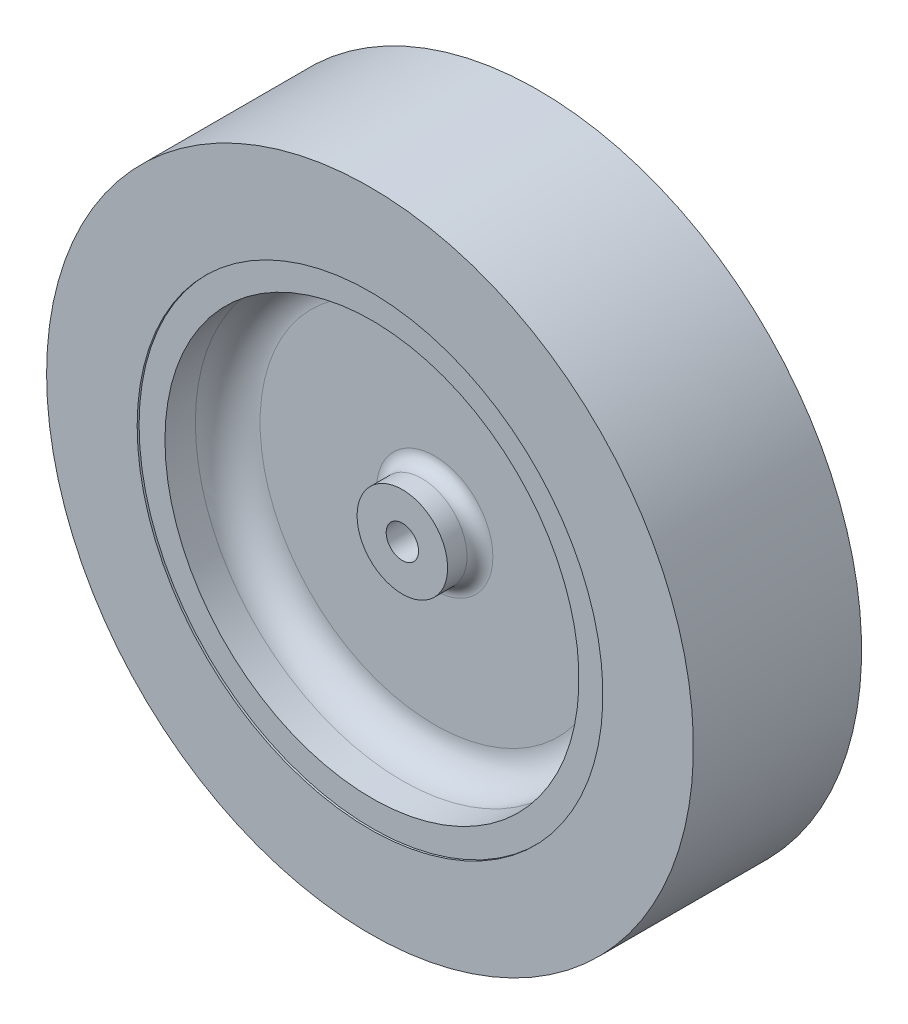
ISO-10303-21;
HEADER;
FILE_DESCRIPTION(('STEP AP214'),'2;1');
FILE_NAME('part.step','',(''),(''),'','','');
FILE_SCHEMA(('AUTOMOTIVE_DESIGN { 1 0 10303 214 1 1 1 1 }'));
ENDSEC;
DATA;
#1=APPLICATION_CONTEXT('core data for automotive mechanical design processes');
#2=APPLICATION_PROTOCOL_DEFINITION('international standard','automotive_design',2000,#1);
#3=PRODUCT_CONTEXT('',#1,'mechanical');
#4=PRODUCT('Part','Part','',(#3));
#5=PRODUCT_RELATED_PRODUCT_CATEGORY('part','',(#4));
#6=PRODUCT_DEFINITION_FORMATION('','',#4);
#7=PRODUCT_DEFINITION_CONTEXT('part definition',#1,'design');
#8=PRODUCT_DEFINITION('design','',#6,#7);
#9=PRODUCT_DEFINITION_SHAPE('','',#8);
#10=(LENGTH_UNIT() NAMED_UNIT(*) SI_UNIT(.MILLI.,.METRE.));
#11=(NAMED_UNIT(*) PLANE_ANGLE_UNIT() SI_UNIT($,.RADIAN.));
#12=(NAMED_UNIT(*) SI_UNIT($,.STERADIAN.) SOLID_ANGLE_UNIT());
#13=UNCERTAINTY_MEASURE_WITH_UNIT(LENGTH_MEASURE(1.E-05),#10,'distance_accuracy_value','');
#14=(GEOMETRIC_REPRESENTATION_CONTEXT(3) GLOBAL_UNCERTAINTY_ASSIGNED_CONTEXT((#13)) GLOBAL_UNIT_ASSIGNED_CONTEXT((#10,
#11,#12)) REPRESENTATION_CONTEXT('',''));
#15=CARTESIAN_POINT('',(0.,0.,0.));
#16=DIRECTION('',(0.,0.,1.));
#17=DIRECTION('',(1.,0.,0.));
#18=AXIS2_PLACEMENT_3D('',#15,#16,#17);
#19=CARTESIAN_POINT('',(0.,0.,-5.52015321528674));
#20=DIRECTION('',(0.,0.,-1.));
#21=DIRECTION('',(-1.,0.,0.));
#22=AXIS2_PLACEMENT_3D('',#19,#20,#21);
#23=CYLINDRICAL_SURFACE('',#22,7.);
#24=CARTESIAN_POINT('',(0.,0.,-5.));
#25=DIRECTION('',(0.,0.,-1.));
#26=DIRECTION('',(-1.,0.,0.));
#27=AXIS2_PLACEMENT_3D('',#24,#25,#26);
#28=CIRCLE('',#27,7.);
#29=CARTESIAN_POINT('',(-7.,0.,-5.));
#30=VERTEX_POINT('',#29);
#31=EDGE_CURVE('E55',#30,#30,#28,.T.);
#32=ORIENTED_EDGE('',*,*,#31,.T.);
#33=EDGE_LOOP('',(#32));
#34=FACE_BOUND('',#33,.T.);
#35=CARTESIAN_POINT('',(0.,0.,-8.));
#36=DIRECTION('',(0.,0.,-1.));
#37=DIRECTION('',(-1.,0.,0.));
#38=AXIS2_PLACEMENT_3D('',#35,#36,#37);
#39=CIRCLE('',#38,7.);
#40=CARTESIAN_POINT('',(-7.,0.,-8.));
#41=VERTEX_POINT('',#40);
#42=EDGE_CURVE('E64',#41,#41,#39,.T.);
#43=ORIENTED_EDGE('',*,*,#42,.F.);
#44=EDGE_LOOP('',(#43));
#45=FACE_BOUND('',#44,.T.);
#46=ADVANCED_FACE('F32',(#34,#45),#23,.T.);
#47=CARTESIAN_POINT('',(0.,7.,-8.));
#48=DIRECTION('',(0.,0.,-1.));
#49=DIRECTION('',(-1.,0.,0.));
#50=AXIS2_PLACEMENT_3D('',#47,#48,#49);
#51=PLANE('',#50);
#52=ORIENTED_EDGE('',*,*,#42,.T.);
#53=EDGE_LOOP('',(#52));
#54=FACE_BOUND('',#53,.T.);
#55=CARTESIAN_POINT('',(0.,0.,-8.));
#56=DIRECTION('',(0.,0.,-1.));
#57=DIRECTION('',(-1.,0.,0.));
#58=AXIS2_PLACEMENT_3D('',#55,#56,#57);
#59=CIRCLE('',#58,2.5);
#60=CARTESIAN_POINT('',(-2.5,0.,-8.));
#61=VERTEX_POINT('',#60);
#62=EDGE_CURVE('E67',#61,#61,#59,.T.);
#63=ORIENTED_EDGE('',*,*,#62,.F.);
#64=EDGE_LOOP('',(#63));
#65=FACE_BOUND('',#64,.T.);
#66=ADVANCED_FACE('F119',(#54,#65),#51,.T.);
#67=CARTESIAN_POINT('',(0.,0.,-5.52015321528674));
#68=DIRECTION('',(0.,0.,-1.));
#69=DIRECTION('',(-1.,0.,0.));
#70=AXIS2_PLACEMENT_3D('',#67,#68,#69);
#71=CYLINDRICAL_SURFACE('',#70,2.5);
#72=ORIENTED_EDGE('',*,*,#62,.T.);
#73=EDGE_LOOP('',(#72));
#74=FACE_BOUND('',#73,.T.);
#75=CARTESIAN_POINT('',(0.,0.,8.));
#76=DIRECTION('',(0.,0.,-1.));
#77=DIRECTION('',(-1.,0.,0.));
#78=AXIS2_PLACEMENT_3D('',#75,#76,#77);
#79=CIRCLE('',#78,2.5);
#80=CARTESIAN_POINT('',(-2.5,0.,8.));
#81=VERTEX_POINT('',#80);
#82=EDGE_CURVE('E70',#81,#81,#79,.T.);
#83=ORIENTED_EDGE('',*,*,#82,.F.);
#84=EDGE_LOOP('',(#83));
#85=FACE_BOUND('',#84,.T.);
#86=ADVANCED_FACE('F125',(#74,#85),#71,.F.);
#87=CARTESIAN_POINT('',(0.,7.,8.));
#88=DIRECTION('',(0.,0.,1.));
#89=DIRECTION('',(1.,0.,0.));
#90=AXIS2_PLACEMENT_3D('',#87,#88,#89);
#91=PLANE('',#90);
#92=ORIENTED_EDGE('',*,*,#82,.T.);
#93=EDGE_LOOP('',(#92));
#94=FACE_BOUND('',#93,.T.);
#95=CARTESIAN_POINT('',(0.,0.,8.));
#96=DIRECTION('',(0.,0.,-1.));
#97=DIRECTION('',(-1.,0.,0.));
#98=AXIS2_PLACEMENT_3D('',#95,#96,#97);
#99=CIRCLE('',#98,7.);
#100=CARTESIAN_POINT('',(-7.,0.,8.));
#101=VERTEX_POINT('',#100);
#102=EDGE_CURVE('E73',#101,#101,#99,.T.);
#103=ORIENTED_EDGE('',*,*,#102,.F.);
#104=EDGE_LOOP('',(#103));
#105=FACE_BOUND('',#104,.T.);
#106=ADVANCED_FACE('F194',(#94,#105),#91,.T.);
#107=CARTESIAN_POINT('',(0.,0.,-5.52015321528674));
#108=DIRECTION('',(0.,0.,-1.));
#109=DIRECTION('',(-1.,0.,0.));
#110=AXIS2_PLACEMENT_3D('',#107,#108,#109);
#111=CYLINDRICAL_SURFACE('',#110,7.);
#112=CARTESIAN_POINT('',(0.,0.,5.));
#113=DIRECTION('',(0.,0.,1.));
#114=DIRECTION('',(1.,0.,0.));
#115=AXIS2_PLACEMENT_3D('',#112,#113,#114);
#116=CIRCLE('',#115,7.);
#117=CARTESIAN_POINT('',(7.,0.,5.));
#118=VERTEX_POINT('',#117);
#119=EDGE_CURVE('E10',#118,#118,#116,.T.);
#120=ORIENTED_EDGE('',*,*,#119,.T.);
#121=EDGE_LOOP('',(#120));
#122=FACE_BOUND('',#121,.T.);
#123=ORIENTED_EDGE('',*,*,#102,.T.);
#124=EDGE_LOOP('',(#123));
#125=FACE_BOUND('',#124,.T.);
#126=ADVANCED_FACE('F191',(#122,#125),#111,.T.);
#127=CARTESIAN_POINT('',(0.,32.,3.));
#128=DIRECTION('',(0.,0.,1.));
#129=DIRECTION('',(1.,0.,0.));
#130=AXIS2_PLACEMENT_3D('',#127,#128,#129);
#131=PLANE('',#130);
#132=CARTESIAN_POINT('',(0.,0.,3.));
#133=DIRECTION('',(0.,0.,1.));
#134=DIRECTION('',(1.,0.,0.));
#135=AXIS2_PLACEMENT_3D('',#132,#133,#134);
#136=CIRCLE('',#135,9.);
#137=CARTESIAN_POINT('',(9.,0.,3.));
#138=VERTEX_POINT('',#137);
#139=EDGE_CURVE('E39',#138,#138,#136,.F.);
#140=ORIENTED_EDGE('',*,*,#139,.T.);
#141=EDGE_LOOP('',(#140));
#142=FACE_BOUND('',#141,.T.);
#143=CARTESIAN_POINT('',(0.,0.,3.));
#144=DIRECTION('',(0.,0.,1.));
#145=DIRECTION('',(1.,0.,0.));
#146=AXIS2_PLACEMENT_3D('',#143,#144,#145);
#147=CIRCLE('',#146,27.);
#148=CARTESIAN_POINT('',(27.,0.,3.));
#149=VERTEX_POINT('',#148);
#150=EDGE_CURVE('E43',#149,#149,#147,.T.);
#151=ORIENTED_EDGE('',*,*,#150,.T.);
#152=EDGE_LOOP('',(#151));
#153=FACE_BOUND('',#152,.T.);
#154=ADVANCED_FACE('F153',(#142,#153),#131,.T.);
#155=CARTESIAN_POINT('',(0.,0.,-5.52015321528674));
#156=DIRECTION('',(0.,0.,-1.));
#157=DIRECTION('',(-1.,0.,0.));
#158=AXIS2_PLACEMENT_3D('',#155,#156,#157);
#159=CYLINDRICAL_SURFACE('',#158,32.);
#160=CARTESIAN_POINT('',(0.,0.,8.));
#161=DIRECTION('',(0.,0.,1.));
#162=DIRECTION('',(1.,0.,0.));
#163=AXIS2_PLACEMENT_3D('',#160,#161,#162);
#164=CIRCLE('',#163,32.);
#165=CARTESIAN_POINT('',(32.,0.,8.));
#166=VERTEX_POINT('',#165);
#167=EDGE_CURVE('E47',#166,#166,#164,.F.);
#168=ORIENTED_EDGE('',*,*,#167,.T.);
#169=EDGE_LOOP('',(#168));
#170=FACE_BOUND('',#169,.T.);
#171=CARTESIAN_POINT('',(0.,0.,12.7));
#172=DIRECTION('',(0.,0.,-1.));
#173=DIRECTION('',(-1.,0.,0.));
#174=AXIS2_PLACEMENT_3D('',#171,#172,#173);
#175=CIRCLE('',#174,32.);
#176=CARTESIAN_POINT('',(-32.,0.,12.7));
#177=VERTEX_POINT('',#176);
#178=EDGE_CURVE('E76',#177,#177,#175,.T.);
#179=ORIENTED_EDGE('',*,*,#178,.F.);
#180=EDGE_LOOP('',(#179));
#181=FACE_BOUND('',#180,.T.);
#182=ADVANCED_FACE('F149',(#170,#181),#159,.F.);
#183=CARTESIAN_POINT('',(0.,36.,12.7));
#184=DIRECTION('',(0.,0.,1.));
#185=DIRECTION('',(1.,0.,0.));
#186=AXIS2_PLACEMENT_3D('',#183,#184,#185);
#187=PLANE('',#186);
#188=ORIENTED_EDGE('',*,*,#178,.T.);
#189=EDGE_LOOP('',(#188));
#190=FACE_BOUND('',#189,.T.);
#191=CARTESIAN_POINT('',(0.,0.,12.7));
#192=DIRECTION('',(0.,0.,-1.));
#193=DIRECTION('',(-1.,0.,0.));
#194=AXIS2_PLACEMENT_3D('',#191,#192,#193);
#195=CIRCLE('',#194,36.);
#196=CARTESIAN_POINT('',(-36.,0.,12.7));
#197=VERTEX_POINT('',#196);
#198=EDGE_CURVE('E79',#197,#197,#195,.T.);
#199=ORIENTED_EDGE('',*,*,#198,.F.);
#200=EDGE_LOOP('',(#199));
#201=FACE_BOUND('',#200,.T.);
#202=ADVANCED_FACE('F152',(#190,#201),#187,.T.);
#203=CARTESIAN_POINT('',(0.,0.,-5.52015321528674));
#204=DIRECTION('',(0.,0.,-1.));
#205=DIRECTION('',(-1.,0.,0.));
#206=AXIS2_PLACEMENT_3D('',#203,#204,#205);
#207=CYLINDRICAL_SURFACE('',#206,36.);
#208=ORIENTED_EDGE('',*,*,#198,.T.);
#209=EDGE_LOOP('',(#208));
#210=FACE_BOUND('',#209,.T.);
#211=CARTESIAN_POINT('',(0.,0.,13.));
#212=DIRECTION('',(0.,0.,-1.));
#213=DIRECTION('',(-1.,0.,0.));
#214=AXIS2_PLACEMENT_3D('',#211,#212,#213);
#215=CIRCLE('',#214,36.);
#216=CARTESIAN_POINT('',(-36.,0.,13.));
#217=VERTEX_POINT('',#216);
#218=EDGE_CURVE('E82',#217,#217,#215,.T.);
#219=ORIENTED_EDGE('',*,*,#218,.F.);
#220=EDGE_LOOP('',(#219));
#221=FACE_BOUND('',#220,.T.);
#222=ADVANCED_FACE('F159',(#210,#221),#207,.F.);
#223=CARTESIAN_POINT('',(0.,50.,13.));
#224=DIRECTION('',(0.,0.,1.));
#225=DIRECTION('',(1.,0.,0.));
#226=AXIS2_PLACEMENT_3D('',#223,#224,#225);
#227=PLANE('',#226);
#228=ORIENTED_EDGE('',*,*,#218,.T.);
#229=EDGE_LOOP('',(#228));
#230=FACE_BOUND('',#229,.T.);
#231=CARTESIAN_POINT('',(0.,0.,13.));
#232=DIRECTION('',(0.,0.,-1.));
#233=DIRECTION('',(-1.,0.,0.));
#234=AXIS2_PLACEMENT_3D('',#231,#232,#233);
#235=CIRCLE('',#234,50.);
#236=CARTESIAN_POINT('',(-50.,0.,13.));
#237=VERTEX_POINT('',#236);
#238=EDGE_CURVE('E85',#237,#237,#235,.T.);
#239=ORIENTED_EDGE('',*,*,#238,.F.);
#240=EDGE_LOOP('',(#239));
#241=FACE_BOUND('',#240,.T.);
#242=ADVANCED_FACE('F165',(#230,#241),#227,.T.);
#243=CARTESIAN_POINT('',(0.,0.,-5.52015321528674));
#244=DIRECTION('',(0.,0.,-1.));
#245=DIRECTION('',(-1.,0.,0.));
#246=AXIS2_PLACEMENT_3D('',#243,#244,#245);
#247=CYLINDRICAL_SURFACE('',#246,50.);
#248=ORIENTED_EDGE('',*,*,#238,.T.);
#249=EDGE_LOOP('',(#248));
#250=FACE_BOUND('',#249,.T.);
#251=CARTESIAN_POINT('',(0.,0.,-13.));
#252=DIRECTION('',(0.,0.,-1.));
#253=DIRECTION('',(-1.,0.,0.));
#254=AXIS2_PLACEMENT_3D('',#251,#252,#253);
#255=CIRCLE('',#254,50.);
#256=CARTESIAN_POINT('',(-50.,0.,-13.));
#257=VERTEX_POINT('',#256);
#258=EDGE_CURVE('E88',#257,#257,#255,.T.);
#259=ORIENTED_EDGE('',*,*,#258,.F.);
#260=EDGE_LOOP('',(#259));
#261=FACE_BOUND('',#260,.T.);
#262=ADVANCED_FACE('F171',(#250,#261),#247,.T.);
#263=CARTESIAN_POINT('',(0.,50.,-13.));
#264=DIRECTION('',(0.,0.,-1.));
#265=DIRECTION('',(-1.,0.,0.));
#266=AXIS2_PLACEMENT_3D('',#263,#264,#265);
#267=PLANE('',#266);
#268=ORIENTED_EDGE('',*,*,#258,.T.);
#269=EDGE_LOOP('',(#268));
#270=FACE_BOUND('',#269,.T.);
#271=CARTESIAN_POINT('',(0.,0.,-13.));
#272=DIRECTION('',(0.,0.,-1.));
#273=DIRECTION('',(-1.,0.,0.));
#274=AXIS2_PLACEMENT_3D('',#271,#272,#273);
#275=CIRCLE('',#274,36.);
#276=CARTESIAN_POINT('',(-36.,0.,-13.));
#277=VERTEX_POINT('',#276);
#278=EDGE_CURVE('E91',#277,#277,#275,.T.);
#279=ORIENTED_EDGE('',*,*,#278,.F.);
#280=EDGE_LOOP('',(#279));
#281=FACE_BOUND('',#280,.T.);
#282=ADVANCED_FACE('F115',(#270,#281),#267,.T.);
#283=CARTESIAN_POINT('',(0.,0.,-5.52015321528674));
#284=DIRECTION('',(0.,0.,-1.));
#285=DIRECTION('',(-1.,0.,0.));
#286=AXIS2_PLACEMENT_3D('',#283,#284,#285);
#287=CYLINDRICAL_SURFACE('',#286,36.);
#288=ORIENTED_EDGE('',*,*,#278,.T.);
#289=EDGE_LOOP('',(#288));
#290=FACE_BOUND('',#289,.T.);
#291=CARTESIAN_POINT('',(0.,0.,-12.7));
#292=DIRECTION('',(0.,0.,-1.));
#293=DIRECTION('',(-1.,0.,0.));
#294=AXIS2_PLACEMENT_3D('',#291,#292,#293);
#295=CIRCLE('',#294,36.);
#296=CARTESIAN_POINT('',(-36.,0.,-12.7));
#297=VERTEX_POINT('',#296);
#298=EDGE_CURVE('E94',#297,#297,#295,.T.);
#299=ORIENTED_EDGE('',*,*,#298,.F.);
#300=EDGE_LOOP('',(#299));
#301=FACE_BOUND('',#300,.T.);
#302=ADVANCED_FACE('F105',(#290,#301),#287,.F.);
#303=CARTESIAN_POINT('',(0.,36.,-12.7));
#304=DIRECTION('',(0.,0.,-1.));
#305=DIRECTION('',(-1.,0.,0.));
#306=AXIS2_PLACEMENT_3D('',#303,#304,#305);
#307=PLANE('',#306);
#308=ORIENTED_EDGE('',*,*,#298,.T.);
#309=EDGE_LOOP('',(#308));
#310=FACE_BOUND('',#309,.T.);
#311=CARTESIAN_POINT('',(0.,0.,-12.7));
#312=DIRECTION('',(0.,0.,-1.));
#313=DIRECTION('',(-1.,0.,0.));
#314=AXIS2_PLACEMENT_3D('',#311,#312,#313);
#315=CIRCLE('',#314,32.);
#316=CARTESIAN_POINT('',(-32.,0.,-12.7));
#317=VERTEX_POINT('',#316);
#318=EDGE_CURVE('E97',#317,#317,#315,.T.);
#319=ORIENTED_EDGE('',*,*,#318,.F.);
#320=EDGE_LOOP('',(#319));
#321=FACE_BOUND('',#320,.T.);
#322=ADVANCED_FACE('F103',(#310,#321),#307,.T.);
#323=CARTESIAN_POINT('',(0.,0.,-5.52015321528674));
#324=DIRECTION('',(0.,0.,-1.));
#325=DIRECTION('',(-1.,0.,0.));
#326=AXIS2_PLACEMENT_3D('',#323,#324,#325);
#327=CYLINDRICAL_SURFACE('',#326,32.);
#328=CARTESIAN_POINT('',(0.,0.,-8.));
#329=DIRECTION('',(0.,0.,-1.));
#330=DIRECTION('',(-1.,0.,0.));
#331=AXIS2_PLACEMENT_3D('',#328,#329,#330);
#332=CIRCLE('',#331,32.);
#333=CARTESIAN_POINT('',(-32.,0.,-8.));
#334=VERTEX_POINT('',#333);
#335=EDGE_CURVE('E58',#334,#334,#332,.F.);
#336=ORIENTED_EDGE('',*,*,#335,.T.);
#337=EDGE_LOOP('',(#336));
#338=FACE_BOUND('',#337,.T.);
#339=ORIENTED_EDGE('',*,*,#318,.T.);
#340=EDGE_LOOP('',(#339));
#341=FACE_BOUND('',#340,.T.);
#342=ADVANCED_FACE('F101',(#338,#341),#327,.F.);
#343=CARTESIAN_POINT('',(0.,32.,-3.));
#344=DIRECTION('',(0.,0.,-1.));
#345=DIRECTION('',(-1.,0.,0.));
#346=AXIS2_PLACEMENT_3D('',#343,#344,#345);
#347=PLANE('',#346);
#348=CARTESIAN_POINT('',(0.,0.,-3.));
#349=DIRECTION('',(0.,0.,-1.));
#350=DIRECTION('',(-1.,0.,0.));
#351=AXIS2_PLACEMENT_3D('',#348,#349,#350);
#352=CIRCLE('',#351,9.);
#353=CARTESIAN_POINT('',(-9.,0.,-3.));
#354=VERTEX_POINT('',#353);
#355=EDGE_CURVE('E52',#354,#354,#352,.F.);
#356=ORIENTED_EDGE('',*,*,#355,.T.);
#357=EDGE_LOOP('',(#356));
#358=FACE_BOUND('',#357,.T.);
#359=CARTESIAN_POINT('',(0.,0.,-3.));
#360=DIRECTION('',(0.,0.,-1.));
#361=DIRECTION('',(-1.,0.,0.));
#362=AXIS2_PLACEMENT_3D('',#359,#360,#361);
#363=CIRCLE('',#362,27.);
#364=CARTESIAN_POINT('',(-27.,0.,-3.));
#365=VERTEX_POINT('',#364);
#366=EDGE_CURVE('E61',#365,#365,#363,.T.);
#367=ORIENTED_EDGE('',*,*,#366,.T.);
#368=EDGE_LOOP('',(#367));
#369=FACE_BOUND('',#368,.T.);
#370=ADVANCED_FACE('F112',(#358,#369),#347,.T.);
#371=CARTESIAN_POINT('',(0.,0.,-8.));
#372=DIRECTION('',(0.,0.,-1.));
#373=DIRECTION('',(-1.,0.,0.));
#374=AXIS2_PLACEMENT_3D('',#371,#372,#373);
#375=TOROIDAL_SURFACE('',#374,27.,5.);
#376=ORIENTED_EDGE('',*,*,#335,.F.);
#377=EDGE_LOOP('',(#376));
#378=FACE_BOUND('',#377,.T.);
#379=ORIENTED_EDGE('',*,*,#366,.F.);
#380=EDGE_LOOP('',(#379));
#381=FACE_BOUND('',#380,.T.);
#382=ADVANCED_FACE('F131',(#378,#381),#375,.F.);
#383=CARTESIAN_POINT('',(0.,0.,-5.));
#384=DIRECTION('',(0.,0.,-1.));
#385=DIRECTION('',(-1.,0.,0.));
#386=AXIS2_PLACEMENT_3D('',#383,#384,#385);
#387=TOROIDAL_SURFACE('',#386,9.,2.);
#388=ORIENTED_EDGE('',*,*,#355,.F.);
#389=EDGE_LOOP('',(#388));
#390=FACE_BOUND('',#389,.T.);
#391=ORIENTED_EDGE('',*,*,#31,.F.);
#392=EDGE_LOOP('',(#391));
#393=FACE_BOUND('',#392,.T.);
#394=ADVANCED_FACE('F134',(#390,#393),#387,.F.);
#395=CARTESIAN_POINT('',(0.,0.,8.));
#396=DIRECTION('',(0.,0.,1.));
#397=DIRECTION('',(1.,0.,0.));
#398=AXIS2_PLACEMENT_3D('',#395,#396,#397);
#399=TOROIDAL_SURFACE('',#398,27.,5.);
#400=ORIENTED_EDGE('',*,*,#150,.F.);
#401=EDGE_LOOP('',(#400));
#402=FACE_BOUND('',#401,.T.);
#403=ORIENTED_EDGE('',*,*,#167,.F.);
#404=EDGE_LOOP('',(#403));
#405=FACE_BOUND('',#404,.T.);
#406=ADVANCED_FACE('F137',(#402,#405),#399,.F.);
#407=CARTESIAN_POINT('',(0.,0.,5.));
#408=DIRECTION('',(0.,0.,1.));
#409=DIRECTION('',(1.,0.,0.));
#410=AXIS2_PLACEMENT_3D('',#407,#408,#409);
#411=TOROIDAL_SURFACE('',#410,9.,2.);
#412=ORIENTED_EDGE('',*,*,#119,.F.);
#413=EDGE_LOOP('',(#412));
#414=FACE_BOUND('',#413,.T.);
#415=ORIENTED_EDGE('',*,*,#139,.F.);
#416=EDGE_LOOP('',(#415));
#417=FACE_BOUND('',#416,.T.);
#418=ADVANCED_FACE('F34',(#414,#417),#411,.F.);
#419=CLOSED_SHELL('',(#46,#66,#86,#106,#126,#154,#182,#202,#222,#242,#262,#282,#302,#322,#342,
#370,#382,#394,#406,#418));
#420=MANIFOLD_SOLID_BREP('B2',#419);
#421=ADVANCED_BREP_SHAPE_REPRESENTATION('',(#18,#420),#14);
#422=SHAPE_DEFINITION_REPRESENTATION(#9,#421);
ENDSEC;
END-ISO-10303-21;
